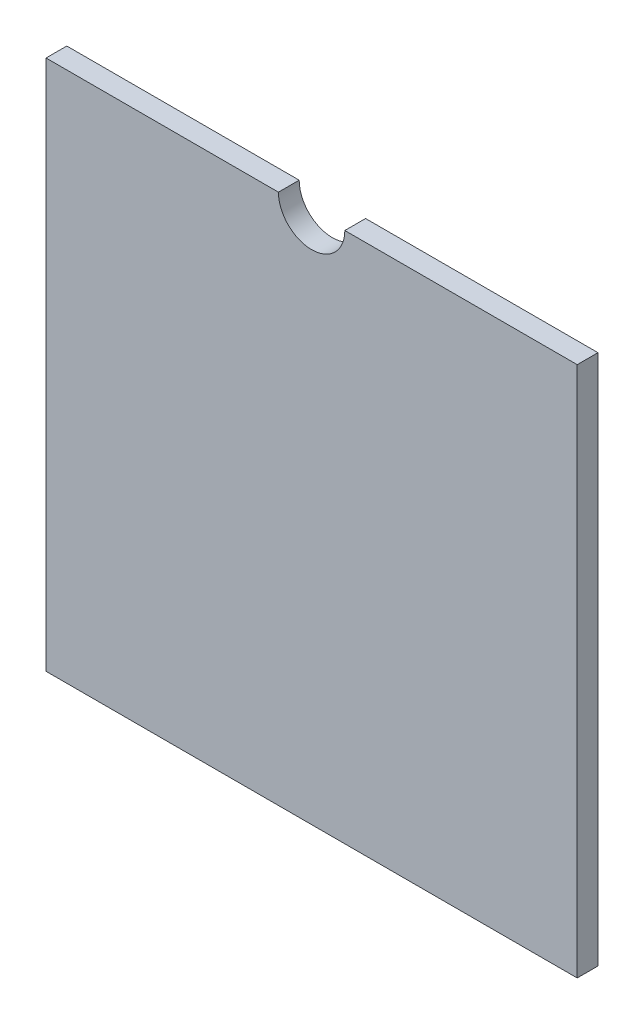
ISO-10303-21;
HEADER;
FILE_DESCRIPTION(('STEP AP214'),'2;1');
FILE_NAME('part.step','',(''),(''),'','','');
FILE_SCHEMA(('AUTOMOTIVE_DESIGN { 1 0 10303 214 1 1 1 1 }'));
ENDSEC;
DATA;
#1=APPLICATION_CONTEXT('core data for automotive mechanical design processes');
#2=APPLICATION_PROTOCOL_DEFINITION('international standard','automotive_design',2000,#1);
#3=PRODUCT_CONTEXT('',#1,'mechanical');
#4=PRODUCT('Part','Part','',(#3));
#5=PRODUCT_RELATED_PRODUCT_CATEGORY('part','',(#4));
#6=PRODUCT_DEFINITION_FORMATION('','',#4);
#7=PRODUCT_DEFINITION_CONTEXT('part definition',#1,'design');
#8=PRODUCT_DEFINITION('design','',#6,#7);
#9=PRODUCT_DEFINITION_SHAPE('','',#8);
#10=(LENGTH_UNIT() NAMED_UNIT(*) SI_UNIT(.MILLI.,.METRE.));
#11=(NAMED_UNIT(*) PLANE_ANGLE_UNIT() SI_UNIT($,.RADIAN.));
#12=(NAMED_UNIT(*) SI_UNIT($,.STERADIAN.) SOLID_ANGLE_UNIT());
#13=UNCERTAINTY_MEASURE_WITH_UNIT(LENGTH_MEASURE(1.E-05),#10,'distance_accuracy_value','');
#14=(GEOMETRIC_REPRESENTATION_CONTEXT(3) GLOBAL_UNCERTAINTY_ASSIGNED_CONTEXT((#13)) GLOBAL_UNIT_ASSIGNED_CONTEXT((#10,
#11,#12)) REPRESENTATION_CONTEXT('',''));
#15=CARTESIAN_POINT('',(0.,0.,0.));
#16=DIRECTION('',(0.,0.,1.));
#17=DIRECTION('',(1.,0.,0.));
#18=AXIS2_PLACEMENT_3D('',#15,#16,#17);
#19=CARTESIAN_POINT('',(101.6,203.2,7.9375));
#20=DIRECTION('',(0.,0.,-1.));
#21=DIRECTION('',(-1.,0.,0.));
#22=AXIS2_PLACEMENT_3D('',#19,#20,#21);
#23=CYLINDRICAL_SURFACE('',#22,12.7);
#24=CARTESIAN_POINT('',(101.6,203.2,0.));
#25=DIRECTION('',(0.,0.,-1.));
#26=DIRECTION('',(1.,0.,0.));
#27=AXIS2_PLACEMENT_3D('',#24,#25,#26);
#28=CIRCLE('',#27,12.7);
#29=CARTESIAN_POINT('',(114.3,203.2,0.));
#30=VERTEX_POINT('',#29);
#31=CARTESIAN_POINT('',(88.9,203.2,0.));
#32=VERTEX_POINT('',#31);
#33=EDGE_CURVE('E119',#30,#32,#28,.T.);
#34=ORIENTED_EDGE('',*,*,#33,.T.);
#35=DIRECTION('',(0.,0.,-1.));
#36=VECTOR('',#35,1.);
#37=CARTESIAN_POINT('',(88.9,203.2,7.9375));
#38=LINE('',#37,#36);
#39=CARTESIAN_POINT('',(88.9,203.2,7.9375));
#40=VERTEX_POINT('',#39);
#41=EDGE_CURVE('E11',#40,#32,#38,.T.);
#42=ORIENTED_EDGE('',*,*,#41,.F.);
#43=CARTESIAN_POINT('',(101.6,203.2,7.9375));
#44=DIRECTION('',(0.,0.,-1.));
#45=DIRECTION('',(1.,0.,0.));
#46=AXIS2_PLACEMENT_3D('',#43,#44,#45);
#47=CIRCLE('',#46,12.7);
#48=CARTESIAN_POINT('',(114.3,203.2,7.9375));
#49=VERTEX_POINT('',#48);
#50=EDGE_CURVE('E129',#49,#40,#47,.T.);
#51=ORIENTED_EDGE('',*,*,#50,.F.);
#52=DIRECTION('',(0.,0.,-1.));
#53=VECTOR('',#52,1.);
#54=CARTESIAN_POINT('',(114.3,203.2,7.9375));
#55=LINE('',#54,#53);
#56=EDGE_CURVE('E115',#49,#30,#55,.T.);
#57=ORIENTED_EDGE('',*,*,#56,.T.);
#58=EDGE_LOOP('',(#34,#42,#51,#57));
#59=FACE_BOUND('',#58,.T.);
#60=ADVANCED_FACE('F35',(#59),#23,.F.);
#61=CARTESIAN_POINT('',(88.9,203.2,7.9375));
#62=DIRECTION('',(0.,-1.,0.));
#63=DIRECTION('',(0.,0.,-1.));
#64=AXIS2_PLACEMENT_3D('',#61,#62,#63);
#65=PLANE('',#64);
#66=DIRECTION('',(-1.,0.,0.));
#67=VECTOR('',#66,1.);
#68=CARTESIAN_POINT('',(88.9,203.2,0.));
#69=LINE('',#68,#67);
#70=CARTESIAN_POINT('',(0.,203.2,0.));
#71=VERTEX_POINT('',#70);
#72=EDGE_CURVE('E122',#32,#71,#69,.T.);
#73=ORIENTED_EDGE('',*,*,#72,.T.);
#74=DIRECTION('',(0.,0.,-1.));
#75=VECTOR('',#74,1.);
#76=CARTESIAN_POINT('',(0.,203.2,7.9375));
#77=LINE('',#76,#75);
#78=CARTESIAN_POINT('',(0.,203.2,7.9375));
#79=VERTEX_POINT('',#78);
#80=EDGE_CURVE('E43',#79,#71,#77,.T.);
#81=ORIENTED_EDGE('',*,*,#80,.F.);
#82=DIRECTION('',(-1.,0.,0.));
#83=VECTOR('',#82,1.);
#84=CARTESIAN_POINT('',(88.9,203.2,7.9375));
#85=LINE('',#84,#83);
#86=EDGE_CURVE('E88',#40,#79,#85,.T.);
#87=ORIENTED_EDGE('',*,*,#86,.F.);
#88=ORIENTED_EDGE('',*,*,#41,.T.);
#89=EDGE_LOOP('',(#73,#81,#87,#88));
#90=FACE_BOUND('',#89,.T.);
#91=ADVANCED_FACE('F153',(#90),#65,.F.);
#92=CARTESIAN_POINT('',(0.,203.2,7.9375));
#93=DIRECTION('',(1.,0.,0.));
#94=DIRECTION('',(0.,1.,0.));
#95=AXIS2_PLACEMENT_3D('',#92,#93,#94);
#96=PLANE('',#95);
#97=DIRECTION('',(0.,-1.,0.));
#98=VECTOR('',#97,1.);
#99=CARTESIAN_POINT('',(0.,203.2,0.));
#100=LINE('',#99,#98);
#101=CARTESIAN_POINT('',(0.,0.,0.));
#102=VERTEX_POINT('',#101);
#103=EDGE_CURVE('E124',#71,#102,#100,.T.);
#104=ORIENTED_EDGE('',*,*,#103,.T.);
#105=DIRECTION('',(0.,0.,-1.));
#106=VECTOR('',#105,1.);
#107=CARTESIAN_POINT('',(0.,0.,7.9375));
#108=LINE('',#107,#106);
#109=CARTESIAN_POINT('',(0.,0.,7.9375));
#110=VERTEX_POINT('',#109);
#111=EDGE_CURVE('E110',#110,#102,#108,.T.);
#112=ORIENTED_EDGE('',*,*,#111,.F.);
#113=DIRECTION('',(0.,-1.,0.));
#114=VECTOR('',#113,1.);
#115=CARTESIAN_POINT('',(0.,203.2,7.9375));
#116=LINE('',#115,#114);
#117=EDGE_CURVE('E101',#79,#110,#116,.T.);
#118=ORIENTED_EDGE('',*,*,#117,.F.);
#119=ORIENTED_EDGE('',*,*,#80,.T.);
#120=EDGE_LOOP('',(#104,#112,#118,#119));
#121=FACE_BOUND('',#120,.T.);
#122=ADVANCED_FACE('F135',(#121),#96,.F.);
#123=CARTESIAN_POINT('',(0.,0.,7.9375));
#124=DIRECTION('',(0.,1.,0.));
#125=DIRECTION('',(0.,0.,1.));
#126=AXIS2_PLACEMENT_3D('',#123,#124,#125);
#127=PLANE('',#126);
#128=DIRECTION('',(1.,0.,0.));
#129=VECTOR('',#128,1.);
#130=CARTESIAN_POINT('',(0.,0.,0.));
#131=LINE('',#130,#129);
#132=CARTESIAN_POINT('',(203.2,0.,0.));
#133=VERTEX_POINT('',#132);
#134=EDGE_CURVE('E109',#102,#133,#131,.T.);
#135=ORIENTED_EDGE('',*,*,#134,.T.);
#136=DIRECTION('',(0.,0.,-1.));
#137=VECTOR('',#136,1.);
#138=CARTESIAN_POINT('',(203.2,0.,7.9375));
#139=LINE('',#138,#137);
#140=CARTESIAN_POINT('',(203.2,0.,7.9375));
#141=VERTEX_POINT('',#140);
#142=EDGE_CURVE('E106',#141,#133,#139,.T.);
#143=ORIENTED_EDGE('',*,*,#142,.F.);
#144=DIRECTION('',(1.,0.,0.));
#145=VECTOR('',#144,1.);
#146=CARTESIAN_POINT('',(0.,0.,7.9375));
#147=LINE('',#146,#145);
#148=EDGE_CURVE('E95',#110,#141,#147,.T.);
#149=ORIENTED_EDGE('',*,*,#148,.F.);
#150=ORIENTED_EDGE('',*,*,#111,.T.);
#151=EDGE_LOOP('',(#135,#143,#149,#150));
#152=FACE_BOUND('',#151,.T.);
#153=ADVANCED_FACE('F107',(#152),#127,.F.);
#154=CARTESIAN_POINT('',(203.2,0.,7.9375));
#155=DIRECTION('',(-1.,0.,0.));
#156=DIRECTION('',(0.,0.,1.));
#157=AXIS2_PLACEMENT_3D('',#154,#155,#156);
#158=PLANE('',#157);
#159=DIRECTION('',(0.,1.,0.));
#160=VECTOR('',#159,1.);
#161=CARTESIAN_POINT('',(203.2,0.,0.));
#162=LINE('',#161,#160);
#163=CARTESIAN_POINT('',(203.2,203.2,0.));
#164=VERTEX_POINT('',#163);
#165=EDGE_CURVE('E74',#133,#164,#162,.T.);
#166=ORIENTED_EDGE('',*,*,#165,.T.);
#167=DIRECTION('',(0.,0.,-1.));
#168=VECTOR('',#167,1.);
#169=CARTESIAN_POINT('',(203.2,203.2,7.9375));
#170=LINE('',#169,#168);
#171=CARTESIAN_POINT('',(203.2,203.2,7.9375));
#172=VERTEX_POINT('',#171);
#173=EDGE_CURVE('E111',#172,#164,#170,.T.);
#174=ORIENTED_EDGE('',*,*,#173,.F.);
#175=DIRECTION('',(0.,1.,0.));
#176=VECTOR('',#175,1.);
#177=CARTESIAN_POINT('',(203.2,0.,7.9375));
#178=LINE('',#177,#176);
#179=EDGE_CURVE('E99',#141,#172,#178,.T.);
#180=ORIENTED_EDGE('',*,*,#179,.F.);
#181=ORIENTED_EDGE('',*,*,#142,.T.);
#182=EDGE_LOOP('',(#166,#174,#180,#181));
#183=FACE_BOUND('',#182,.T.);
#184=ADVANCED_FACE('F113',(#183),#158,.F.);
#185=CARTESIAN_POINT('',(203.2,203.2,7.9375));
#186=DIRECTION('',(0.,-1.,0.));
#187=DIRECTION('',(1.,0.,0.));
#188=AXIS2_PLACEMENT_3D('',#185,#186,#187);
#189=PLANE('',#188);
#190=DIRECTION('',(-1.,0.,0.));
#191=VECTOR('',#190,1.);
#192=CARTESIAN_POINT('',(203.2,203.2,0.));
#193=LINE('',#192,#191);
#194=EDGE_CURVE('E80',#164,#30,#193,.T.);
#195=ORIENTED_EDGE('',*,*,#194,.T.);
#196=ORIENTED_EDGE('',*,*,#56,.F.);
#197=DIRECTION('',(-1.,0.,0.));
#198=VECTOR('',#197,1.);
#199=CARTESIAN_POINT('',(203.2,203.2,7.9375));
#200=LINE('',#199,#198);
#201=EDGE_CURVE('E51',#172,#49,#200,.T.);
#202=ORIENTED_EDGE('',*,*,#201,.F.);
#203=ORIENTED_EDGE('',*,*,#173,.T.);
#204=EDGE_LOOP('',(#195,#196,#202,#203));
#205=FACE_BOUND('',#204,.T.);
#206=ADVANCED_FACE('F142',(#205),#189,.F.);
#207=CARTESIAN_POINT('',(101.6,203.2,7.9375));
#208=DIRECTION('',(0.,0.,1.));
#209=DIRECTION('',(1.,0.,0.));
#210=AXIS2_PLACEMENT_3D('',#207,#208,#209);
#211=PLANE('',#210);
#212=ORIENTED_EDGE('',*,*,#50,.T.);
#213=ORIENTED_EDGE('',*,*,#86,.T.);
#214=ORIENTED_EDGE('',*,*,#117,.T.);
#215=ORIENTED_EDGE('',*,*,#148,.T.);
#216=ORIENTED_EDGE('',*,*,#179,.T.);
#217=ORIENTED_EDGE('',*,*,#201,.T.);
#218=EDGE_LOOP('',(#212,#213,#214,#215,#216,#217));
#219=FACE_BOUND('',#218,.T.);
#220=ADVANCED_FACE('F97',(#219),#211,.T.);
#221=CARTESIAN_POINT('',(101.6,203.2,0.));
#222=DIRECTION('',(0.,0.,1.));
#223=DIRECTION('',(1.,0.,0.));
#224=AXIS2_PLACEMENT_3D('',#221,#222,#223);
#225=PLANE('',#224);
#226=ORIENTED_EDGE('',*,*,#33,.F.);
#227=ORIENTED_EDGE('',*,*,#194,.F.);
#228=ORIENTED_EDGE('',*,*,#165,.F.);
#229=ORIENTED_EDGE('',*,*,#134,.F.);
#230=ORIENTED_EDGE('',*,*,#103,.F.);
#231=ORIENTED_EDGE('',*,*,#72,.F.);
#232=EDGE_LOOP('',(#226,#227,#228,#229,#230,#231));
#233=FACE_BOUND('',#232,.T.);
#234=ADVANCED_FACE('F138',(#233),#225,.F.);
#235=CLOSED_SHELL('',(#60,#91,#122,#153,#184,#206,#220,#234));
#236=MANIFOLD_SOLID_BREP('B2',#235);
#237=ADVANCED_BREP_SHAPE_REPRESENTATION('',(#18,#236),#14);
#238=SHAPE_DEFINITION_REPRESENTATION(#9,#237);
ENDSEC;
END-ISO-10303-21;
